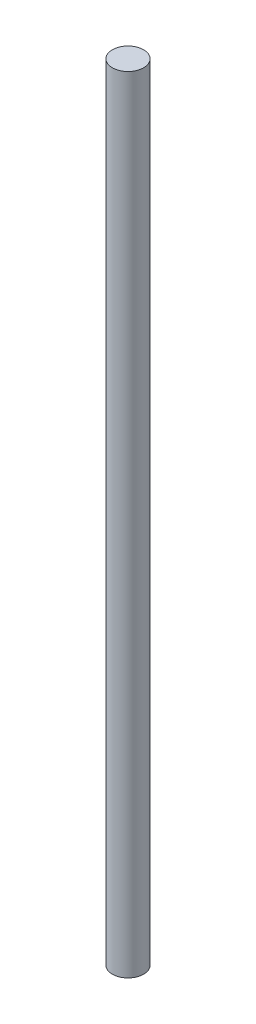
ISO-10303-21;
HEADER;
FILE_DESCRIPTION(('STEP AP214'),'2;1');
FILE_NAME('part.step','',(''),(''),'','','');
FILE_SCHEMA(('AUTOMOTIVE_DESIGN { 1 0 10303 214 1 1 1 1 }'));
ENDSEC;
DATA;
#1=APPLICATION_CONTEXT('core data for automotive mechanical design processes');
#2=APPLICATION_PROTOCOL_DEFINITION('international standard','automotive_design',2000,#1);
#3=PRODUCT_CONTEXT('',#1,'mechanical');
#4=PRODUCT('Part','Part','',(#3));
#5=PRODUCT_RELATED_PRODUCT_CATEGORY('part','',(#4));
#6=PRODUCT_DEFINITION_FORMATION('','',#4);
#7=PRODUCT_DEFINITION_CONTEXT('part definition',#1,'design');
#8=PRODUCT_DEFINITION('design','',#6,#7);
#9=PRODUCT_DEFINITION_SHAPE('','',#8);
#10=(LENGTH_UNIT() NAMED_UNIT(*) SI_UNIT(.MILLI.,.METRE.));
#11=(NAMED_UNIT(*) PLANE_ANGLE_UNIT() SI_UNIT($,.RADIAN.));
#12=(NAMED_UNIT(*) SI_UNIT($,.STERADIAN.) SOLID_ANGLE_UNIT());
#13=UNCERTAINTY_MEASURE_WITH_UNIT(LENGTH_MEASURE(1.E-05),#10,'distance_accuracy_value','');
#14=(GEOMETRIC_REPRESENTATION_CONTEXT(3) GLOBAL_UNCERTAINTY_ASSIGNED_CONTEXT((#13)) GLOBAL_UNIT_ASSIGNED_CONTEXT((#10,
#11,#12)) REPRESENTATION_CONTEXT('',''));
#15=CARTESIAN_POINT('',(0.,0.,0.));
#16=DIRECTION('',(0.,0.,1.));
#17=DIRECTION('',(1.,0.,0.));
#18=AXIS2_PLACEMENT_3D('',#15,#16,#17);
#19=CARTESIAN_POINT('',(0.,239.,0.));
#20=DIRECTION('',(0.,1.,0.));
#21=DIRECTION('',(-1.,0.,0.));
#22=AXIS2_PLACEMENT_3D('',#19,#20,#21);
#23=PLANE('',#22);
#24=CARTESIAN_POINT('',(4.7625,239.,0.));
#25=DIRECTION('',(0.,1.,0.));
#26=DIRECTION('',(-1.,0.,0.));
#27=AXIS2_PLACEMENT_3D('',#24,#25,#26);
#28=CIRCLE('',#27,4.7625);
#29=CARTESIAN_POINT('',(0.,239.,0.));
#30=VERTEX_POINT('',#29);
#31=EDGE_CURVE('E10',#30,#30,#28,.T.);
#32=ORIENTED_EDGE('',*,*,#31,.T.);
#33=EDGE_LOOP('',(#32));
#34=FACE_BOUND('',#33,.T.);
#35=ADVANCED_FACE('F36',(#34),#23,.T.);
#36=CARTESIAN_POINT('',(4.7625,239.,0.));
#37=DIRECTION('',(0.,1.,0.));
#38=DIRECTION('',(-1.,0.,0.));
#39=AXIS2_PLACEMENT_3D('',#36,#37,#38);
#40=CYLINDRICAL_SURFACE('',#39,4.76250000000002);
#41=CARTESIAN_POINT('',(4.76250000000003,0.,0.));
#42=DIRECTION('',(0.,1.,0.));
#43=DIRECTION('',(-1.,0.,0.));
#44=AXIS2_PLACEMENT_3D('',#41,#42,#43);
#45=CIRCLE('',#44,4.76250000000003);
#46=CARTESIAN_POINT('',(0.,0.,0.));
#47=VERTEX_POINT('',#46);
#48=EDGE_CURVE('E42',#47,#47,#45,.T.);
#49=ORIENTED_EDGE('',*,*,#48,.T.);
#50=EDGE_LOOP('',(#49));
#51=FACE_BOUND('',#50,.T.);
#52=ORIENTED_EDGE('',*,*,#31,.F.);
#53=EDGE_LOOP('',(#52));
#54=FACE_BOUND('',#53,.T.);
#55=ADVANCED_FACE('F48',(#51,#54),#40,.T.);
#56=CARTESIAN_POINT('',(0.,0.,0.));
#57=DIRECTION('',(0.,-1.,0.));
#58=DIRECTION('',(1.,0.,0.));
#59=AXIS2_PLACEMENT_3D('',#56,#57,#58);
#60=PLANE('',#59);
#61=ORIENTED_EDGE('',*,*,#48,.F.);
#62=EDGE_LOOP('',(#61));
#63=FACE_BOUND('',#62,.T.);
#64=ADVANCED_FACE('F51',(#63),#60,.T.);
#65=CLOSED_SHELL('',(#35,#55,#64));
#66=MANIFOLD_SOLID_BREP('B2',#65);
#67=ADVANCED_BREP_SHAPE_REPRESENTATION('',(#18,#66),#14);
#68=SHAPE_DEFINITION_REPRESENTATION(#9,#67);
ENDSEC;
END-ISO-10303-21;
